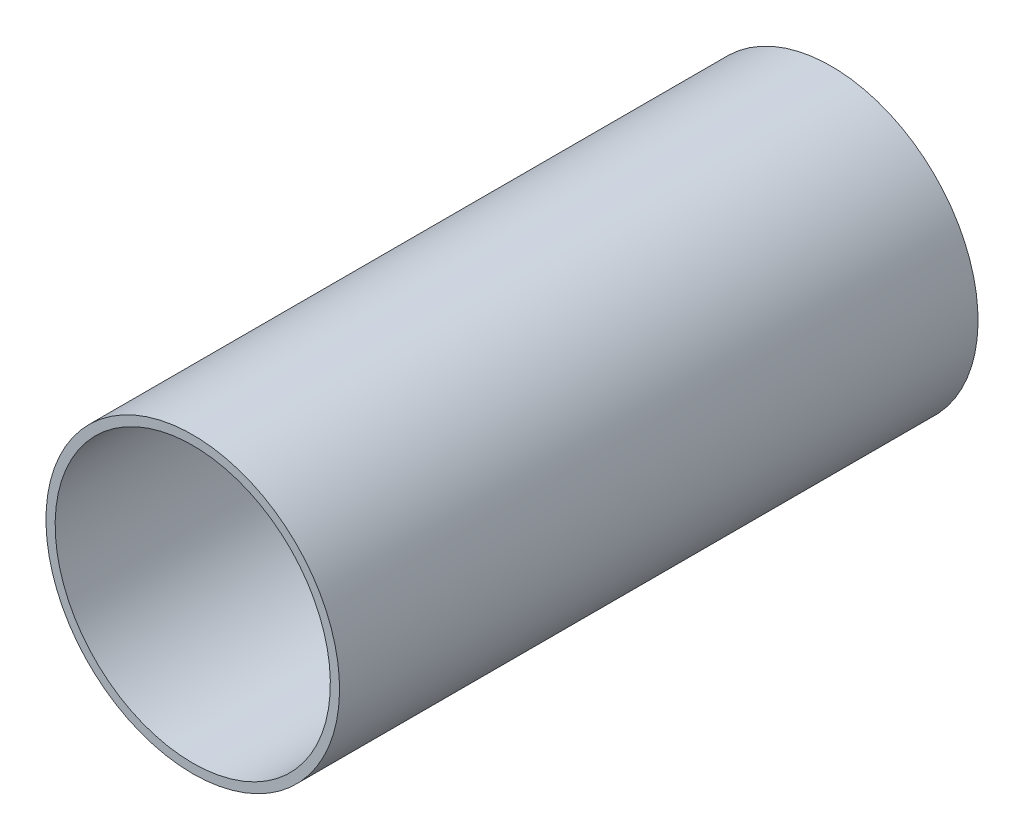
ISO-10303-21;
HEADER;
FILE_DESCRIPTION(('STEP AP214'),'2;1');
FILE_NAME('part.step','',(''),(''),'','','');
FILE_SCHEMA(('AUTOMOTIVE_DESIGN { 1 0 10303 214 1 1 1 1 }'));
ENDSEC;
DATA;
#1=APPLICATION_CONTEXT('core data for automotive mechanical design processes');
#2=APPLICATION_PROTOCOL_DEFINITION('international standard','automotive_design',2000,#1);
#3=PRODUCT_CONTEXT('',#1,'mechanical');
#4=PRODUCT('Part','Part','',(#3));
#5=PRODUCT_RELATED_PRODUCT_CATEGORY('part','',(#4));
#6=PRODUCT_DEFINITION_FORMATION('','',#4);
#7=PRODUCT_DEFINITION_CONTEXT('part definition',#1,'design');
#8=PRODUCT_DEFINITION('design','',#6,#7);
#9=PRODUCT_DEFINITION_SHAPE('','',#8);
#10=(LENGTH_UNIT() NAMED_UNIT(*) SI_UNIT(.MILLI.,.METRE.));
#11=(NAMED_UNIT(*) PLANE_ANGLE_UNIT() SI_UNIT($,.RADIAN.));
#12=(NAMED_UNIT(*) SI_UNIT($,.STERADIAN.) SOLID_ANGLE_UNIT());
#13=UNCERTAINTY_MEASURE_WITH_UNIT(LENGTH_MEASURE(1.E-05),#10,'distance_accuracy_value','');
#14=(GEOMETRIC_REPRESENTATION_CONTEXT(3) GLOBAL_UNCERTAINTY_ASSIGNED_CONTEXT((#13)) GLOBAL_UNIT_ASSIGNED_CONTEXT((#10,
#11,#12)) REPRESENTATION_CONTEXT('',''));
#15=CARTESIAN_POINT('',(0.,0.,0.));
#16=DIRECTION('',(0.,0.,1.));
#17=DIRECTION('',(1.,0.,0.));
#18=AXIS2_PLACEMENT_3D('',#15,#16,#17);
#19=CARTESIAN_POINT('',(127.,-80.772,-0.045));
#20=DIRECTION('',(0.,0.,-1.));
#21=DIRECTION('',(0.,-1.,0.));
#22=AXIS2_PLACEMENT_3D('',#19,#20,#21);
#23=CYLINDRICAL_SURFACE('',#22,0.375);
#24=CARTESIAN_POINT('',(127.,-80.772,-0.035));
#25=DIRECTION('',(0.,0.,-1.));
#26=DIRECTION('',(0.,-1.,0.));
#27=AXIS2_PLACEMENT_3D('',#24,#25,#26);
#28=CIRCLE('',#27,0.375);
#29=CARTESIAN_POINT('',(127.,-81.147,-0.035));
#30=VERTEX_POINT('',#29);
#31=EDGE_CURVE('E64',#30,#30,#28,.T.);
#32=ORIENTED_EDGE('',*,*,#31,.T.);
#33=DIRECTION('',(0.,0.,1.));
#34=VECTOR('',#33,1.);
#35=CARTESIAN_POINT('',(127.,-81.147,-0.045));
#36=LINE('',#35,#34);
#37=CARTESIAN_POINT('',(127.,-81.147,1.705));
#38=VERTEX_POINT('',#37);
#39=EDGE_CURVE('E11',#30,#38,#36,.T.);
#40=ORIENTED_EDGE('',*,*,#39,.T.);
#41=CARTESIAN_POINT('',(127.,-80.772,1.705));
#42=DIRECTION('',(0.,0.,-1.));
#43=DIRECTION('',(0.,-1.,0.));
#44=AXIS2_PLACEMENT_3D('',#41,#42,#43);
#45=CIRCLE('',#44,0.375);
#46=EDGE_CURVE('E25',#38,#38,#45,.T.);
#47=ORIENTED_EDGE('',*,*,#46,.F.);
#48=ORIENTED_EDGE('',*,*,#39,.F.);
#49=EDGE_LOOP('',(#32,#40,#47,#48));
#50=FACE_BOUND('',#49,.T.);
#51=ADVANCED_FACE('F17',(#50),#23,.F.);
#52=CARTESIAN_POINT('',(127.,-81.172,1.705));
#53=DIRECTION('',(0.,0.,1.));
#54=DIRECTION('',(1.,0.,0.));
#55=AXIS2_PLACEMENT_3D('',#52,#53,#54);
#56=PLANE('',#55);
#57=ORIENTED_EDGE('',*,*,#46,.T.);
#58=EDGE_LOOP('',(#57));
#59=FACE_BOUND('',#58,.T.);
#60=CARTESIAN_POINT('',(127.,-80.772,1.705));
#61=DIRECTION('',(0.,0.,1.));
#62=DIRECTION('',(0.,-1.,0.));
#63=AXIS2_PLACEMENT_3D('',#60,#61,#62);
#64=CIRCLE('',#63,0.4);
#65=CARTESIAN_POINT('',(127.,-81.172,1.705));
#66=VERTEX_POINT('',#65);
#67=EDGE_CURVE('E56',#66,#66,#64,.T.);
#68=ORIENTED_EDGE('',*,*,#67,.T.);
#69=EDGE_LOOP('',(#68));
#70=FACE_BOUND('',#69,.T.);
#71=ADVANCED_FACE('F73',(#59,#70),#56,.T.);
#72=CARTESIAN_POINT('',(127.,-81.172,-0.035));
#73=DIRECTION('',(0.,0.,1.));
#74=DIRECTION('',(1.,0.,0.));
#75=AXIS2_PLACEMENT_3D('',#72,#73,#74);
#76=PLANE('',#75);
#77=ORIENTED_EDGE('',*,*,#31,.F.);
#78=EDGE_LOOP('',(#77));
#79=FACE_BOUND('',#78,.T.);
#80=CARTESIAN_POINT('',(127.,-80.772,-0.035));
#81=DIRECTION('',(0.,0.,1.));
#82=DIRECTION('',(0.,-1.,0.));
#83=AXIS2_PLACEMENT_3D('',#80,#81,#82);
#84=CIRCLE('',#83,0.4);
#85=CARTESIAN_POINT('',(127.,-81.172,-0.035));
#86=VERTEX_POINT('',#85);
#87=EDGE_CURVE('E55',#86,#86,#84,.T.);
#88=ORIENTED_EDGE('',*,*,#87,.F.);
#89=EDGE_LOOP('',(#88));
#90=FACE_BOUND('',#89,.T.);
#91=ADVANCED_FACE('F82',(#79,#90),#76,.F.);
#92=CARTESIAN_POINT('',(127.,-80.772,-0.035));
#93=DIRECTION('',(0.,0.,-1.));
#94=DIRECTION('',(0.,-1.,0.));
#95=AXIS2_PLACEMENT_3D('',#92,#93,#94);
#96=CYLINDRICAL_SURFACE('',#95,0.4);
#97=ORIENTED_EDGE('',*,*,#87,.T.);
#98=DIRECTION('',(0.,0.,1.));
#99=VECTOR('',#98,1.);
#100=CARTESIAN_POINT('',(127.,-81.172,-0.035));
#101=LINE('',#100,#99);
#102=EDGE_CURVE('E52',#86,#66,#101,.T.);
#103=ORIENTED_EDGE('',*,*,#102,.T.);
#104=ORIENTED_EDGE('',*,*,#67,.F.);
#105=ORIENTED_EDGE('',*,*,#102,.F.);
#106=EDGE_LOOP('',(#97,#103,#104,#105));
#107=FACE_BOUND('',#106,.T.);
#108=ADVANCED_FACE('F53',(#107),#96,.T.);
#109=CLOSED_SHELL('',(#51,#71,#91,#108));
#110=MANIFOLD_SOLID_BREP('B1',#109);
#111=ADVANCED_BREP_SHAPE_REPRESENTATION('',(#18,#110),#14);
#112=SHAPE_DEFINITION_REPRESENTATION(#9,#111);
ENDSEC;
END-ISO-10303-21;
